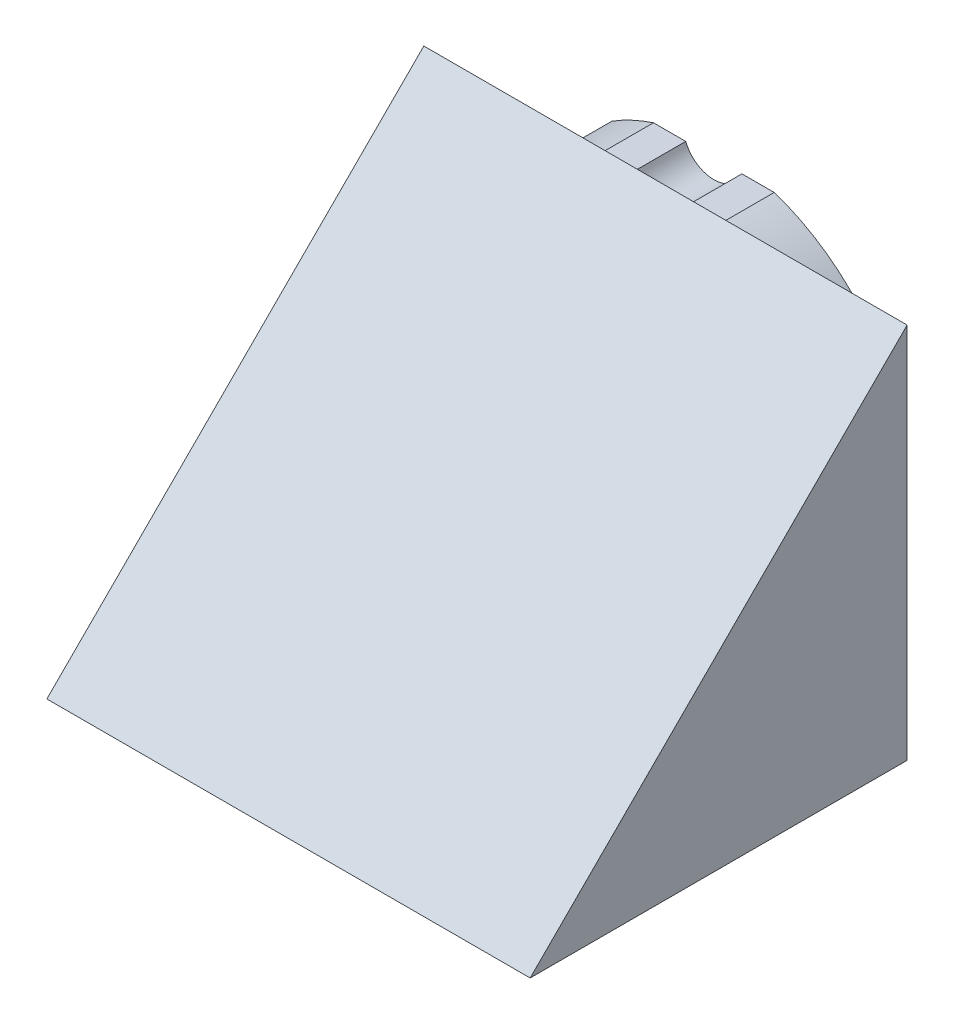
ISO-10303-21;
HEADER;
FILE_DESCRIPTION(('STEP AP214'),'2;1');
FILE_NAME('part.step','',(''),(''),'','','');
FILE_SCHEMA(('AUTOMOTIVE_DESIGN { 1 0 10303 214 1 1 1 1 }'));
ENDSEC;
DATA;
#1=APPLICATION_CONTEXT('core data for automotive mechanical design processes');
#2=APPLICATION_PROTOCOL_DEFINITION('international standard','automotive_design',2000,#1);
#3=PRODUCT_CONTEXT('',#1,'mechanical');
#4=PRODUCT('Part','Part','',(#3));
#5=PRODUCT_RELATED_PRODUCT_CATEGORY('part','',(#4));
#6=PRODUCT_DEFINITION_FORMATION('','',#4);
#7=PRODUCT_DEFINITION_CONTEXT('part definition',#1,'design');
#8=PRODUCT_DEFINITION('design','',#6,#7);
#9=PRODUCT_DEFINITION_SHAPE('','',#8);
#10=(LENGTH_UNIT() NAMED_UNIT(*) SI_UNIT(.MILLI.,.METRE.));
#11=(NAMED_UNIT(*) PLANE_ANGLE_UNIT() SI_UNIT($,.RADIAN.));
#12=(NAMED_UNIT(*) SI_UNIT($,.STERADIAN.) SOLID_ANGLE_UNIT());
#13=UNCERTAINTY_MEASURE_WITH_UNIT(LENGTH_MEASURE(1.E-05),#10,'distance_accuracy_value','');
#14=(GEOMETRIC_REPRESENTATION_CONTEXT(3) GLOBAL_UNCERTAINTY_ASSIGNED_CONTEXT((#13)) GLOBAL_UNIT_ASSIGNED_CONTEXT((#10,
#11,#12)) REPRESENTATION_CONTEXT('',''));
#15=CARTESIAN_POINT('',(0.,0.,0.));
#16=DIRECTION('',(0.,0.,1.));
#17=DIRECTION('',(1.,0.,0.));
#18=AXIS2_PLACEMENT_3D('',#15,#16,#17);
#19=CARTESIAN_POINT('',(-1.11022302462516E-13,40.3000000000001,9.99999999999989));
#20=DIRECTION('',(0.,0.,-1.));
#21=DIRECTION('',(-1.,0.,0.));
#22=AXIS2_PLACEMENT_3D('',#19,#20,#21);
#23=CYLINDRICAL_SURFACE('',#22,6.25);
#24=CARTESIAN_POINT('',(-1.11022302462516E-13,40.3000000000001,-1.11022302462516E-13));
#25=DIRECTION('',(0.,0.,1.));
#26=DIRECTION('',(0.999999999999998,0.,0.));
#27=AXIS2_PLACEMENT_3D('',#24,#25,#26);
#28=CIRCLE('',#27,6.25);
#29=CARTESIAN_POINT('',(5.81141115778711,37.9999999227946,-1.11022302462516E-13));
#30=VERTEX_POINT('',#29);
#31=CARTESIAN_POINT('',(-5.81141115778742,37.9999999227946,-1.66533453693773E-13));
#32=VERTEX_POINT('',#31);
#33=EDGE_CURVE('E216',#30,#32,#28,.F.);
#34=ORIENTED_EDGE('',*,*,#33,.T.);
#35=DIRECTION('',(0.,0.,-1.));
#36=VECTOR('',#35,1.);
#37=CARTESIAN_POINT('',(-5.81141115778742,37.9999999227946,9.99999999999983));
#38=LINE('',#37,#36);
#39=CARTESIAN_POINT('',(-5.81141115778742,37.9999999227946,9.99999999999983));
#40=VERTEX_POINT('',#39);
#41=EDGE_CURVE('E11',#40,#32,#38,.T.);
#42=ORIENTED_EDGE('',*,*,#41,.F.);
#43=CARTESIAN_POINT('',(-1.11022302462516E-13,40.3000000000001,9.99999999999989));
#44=DIRECTION('',(0.,0.,1.));
#45=DIRECTION('',(0.999999999999998,0.,0.));
#46=AXIS2_PLACEMENT_3D('',#43,#44,#45);
#47=CIRCLE('',#46,6.25);
#48=CARTESIAN_POINT('',(5.81141115778711,37.9999999227946,9.99999999999989));
#49=VERTEX_POINT('',#48);
#50=EDGE_CURVE('E368',#49,#40,#47,.F.);
#51=ORIENTED_EDGE('',*,*,#50,.F.);
#52=DIRECTION('',(0.,0.,-1.));
#53=VECTOR('',#52,1.);
#54=CARTESIAN_POINT('',(5.81141115778711,37.9999999227946,9.99999999999989));
#55=LINE('',#54,#53);
#56=EDGE_CURVE('E57',#49,#30,#55,.T.);
#57=ORIENTED_EDGE('',*,*,#56,.T.);
#58=EDGE_LOOP('',(#34,#42,#51,#57));
#59=FACE_BOUND('',#58,.T.);
#60=ADVANCED_FACE('F33',(#59),#23,.F.);
#61=CARTESIAN_POINT('',(-1.66533453693773E-13,38.0000000000001,9.99999999999972));
#62=DIRECTION('',(0.,-1.,0.));
#63=DIRECTION('',(1.,0.,0.));
#64=AXIS2_PLACEMENT_3D('',#61,#62,#63);
#65=PLANE('',#64);
#66=DIRECTION('',(-0.999999999999998,0.,0.));
#67=VECTOR('',#66,1.);
#68=CARTESIAN_POINT('',(-1.66533453693773E-13,38.0000000000001,-2.77555756156289E-13));
#69=LINE('',#68,#67);
#70=CARTESIAN_POINT('',(-12.4899964724862,37.9999998436485,-1.11022302462516E-13));
#71=VERTEX_POINT('',#70);
#72=EDGE_CURVE('E219',#32,#71,#69,.T.);
#73=ORIENTED_EDGE('',*,*,#72,.T.);
#74=DIRECTION('',(0.,0.,-1.));
#75=VECTOR('',#74,1.);
#76=CARTESIAN_POINT('',(-12.4899964724862,37.9999998436485,9.99999999999989));
#77=LINE('',#76,#75);
#78=CARTESIAN_POINT('',(-12.4899964724862,37.9999998436485,9.99999999999989));
#79=VERTEX_POINT('',#78);
#80=EDGE_CURVE('E41',#79,#71,#77,.T.);
#81=ORIENTED_EDGE('',*,*,#80,.F.);
#82=DIRECTION('',(-0.999999999999998,0.,0.));
#83=VECTOR('',#82,1.);
#84=CARTESIAN_POINT('',(-1.66533453693773E-13,38.0000000000001,9.99999999999972));
#85=LINE('',#84,#83);
#86=EDGE_CURVE('E126',#40,#79,#85,.T.);
#87=ORIENTED_EDGE('',*,*,#86,.F.);
#88=ORIENTED_EDGE('',*,*,#41,.T.);
#89=EDGE_LOOP('',(#73,#81,#87,#88));
#90=FACE_BOUND('',#89,.T.);
#91=ADVANCED_FACE('F433',(#90),#65,.F.);
#92=CARTESIAN_POINT('',(-1.11022302462516E-13,0.,9.99999999999972));
#93=DIRECTION('',(0.,0.,-1.));
#94=DIRECTION('',(-1.,0.,0.));
#95=AXIS2_PLACEMENT_3D('',#92,#93,#94);
#96=CYLINDRICAL_SURFACE('',#95,40.);
#97=CARTESIAN_POINT('',(-1.11022302462516E-13,0.,-2.77555756156289E-13));
#98=DIRECTION('',(0.,0.,1.));
#99=DIRECTION('',(0.999999999999998,0.,0.));
#100=AXIS2_PLACEMENT_3D('',#97,#98,#99);
#101=CIRCLE('',#100,40.);
#102=CARTESIAN_POINT('',(-21.0896489382124,33.9886261514491,-1.11022302462516E-13));
#103=VERTEX_POINT('',#102);
#104=EDGE_CURVE('E221',#71,#103,#101,.T.);
#105=ORIENTED_EDGE('',*,*,#104,.T.);
#106=DIRECTION('',(0.,0.,-1.));
#107=VECTOR('',#106,1.);
#108=CARTESIAN_POINT('',(-21.0896489382124,33.9886261514491,9.99999999999989));
#109=LINE('',#108,#107);
#110=CARTESIAN_POINT('',(-21.0896489382124,33.9886261514491,9.99999999999989));
#111=VERTEX_POINT('',#110);
#112=EDGE_CURVE('E287',#111,#103,#109,.T.);
#113=ORIENTED_EDGE('',*,*,#112,.F.);
#114=CARTESIAN_POINT('',(-1.11022302462516E-13,0.,9.99999999999972));
#115=DIRECTION('',(0.,0.,1.));
#116=DIRECTION('',(0.999999999999998,0.,0.));
#117=AXIS2_PLACEMENT_3D('',#114,#115,#116);
#118=CIRCLE('',#117,40.);
#119=EDGE_CURVE('E295',#79,#111,#118,.T.);
#120=ORIENTED_EDGE('',*,*,#119,.F.);
#121=ORIENTED_EDGE('',*,*,#80,.T.);
#122=EDGE_LOOP('',(#105,#113,#120,#121));
#123=FACE_BOUND('',#122,.T.);
#124=ADVANCED_FACE('F293',(#123),#96,.T.);
#125=CARTESIAN_POINT('',(3.88572980728433,3.14660195524888,9.99999999999983));
#126=DIRECTION('',(0.777145961456976,0.629320391049832,0.));
#127=DIRECTION('',(-0.629320391049832,0.777145961456976,0.));
#128=AXIS2_PLACEMENT_3D('',#125,#126,#127);
#129=PLANE('',#128);
#130=DIRECTION('',(0.629320391049832,-0.777145961456976,0.));
#131=VECTOR('',#130,1.);
#132=CARTESIAN_POINT('',(3.88572980728433,3.14660195524888,-1.66533453693773E-13));
#133=LINE('',#132,#131);
#134=CARTESIAN_POINT('',(-17.322367367557,29.33642085198,-1.11022302462516E-13));
#135=VERTEX_POINT('',#134);
#136=EDGE_CURVE('E223',#103,#135,#133,.T.);
#137=ORIENTED_EDGE('',*,*,#136,.T.);
#138=DIRECTION('',(0.,0.,-1.));
#139=VECTOR('',#138,1.);
#140=CARTESIAN_POINT('',(-17.322367367557,29.33642085198,9.99999999999989));
#141=LINE('',#140,#139);
#142=CARTESIAN_POINT('',(-17.322367367557,29.33642085198,9.99999999999989));
#143=VERTEX_POINT('',#142);
#144=EDGE_CURVE('E284',#143,#135,#141,.T.);
#145=ORIENTED_EDGE('',*,*,#144,.F.);
#146=DIRECTION('',(0.629320391049832,-0.777145961456976,0.));
#147=VECTOR('',#146,1.);
#148=CARTESIAN_POINT('',(3.88572980728433,3.14660195524888,9.99999999999983));
#149=LINE('',#148,#147);
#150=EDGE_CURVE('E316',#111,#143,#149,.T.);
#151=ORIENTED_EDGE('',*,*,#150,.F.);
#152=ORIENTED_EDGE('',*,*,#112,.T.);
#153=EDGE_LOOP('',(#137,#145,#151,#152));
#154=FACE_BOUND('',#153,.T.);
#155=ADVANCED_FACE('F304',(#154),#129,.F.);
#156=CARTESIAN_POINT('',(-19.032088486301,27.9519159960392,9.99999999999983));
#157=DIRECTION('',(0.,0.,-1.));
#158=DIRECTION('',(-1.,0.,0.));
#159=AXIS2_PLACEMENT_3D('',#156,#157,#158);
#160=CYLINDRICAL_SURFACE('',#159,2.20000000000058);
#161=CARTESIAN_POINT('',(-19.032088486301,27.9519159960392,-1.66533453693773E-13));
#162=DIRECTION('',(0.,0.,1.));
#163=DIRECTION('',(0.999999999999998,0.,0.));
#164=AXIS2_PLACEMENT_3D('',#161,#162,#163);
#165=CIRCLE('',#164,2.20000000000058);
#166=CARTESIAN_POINT('',(-17.6475836259901,26.2421948808341,0.));
#167=VERTEX_POINT('',#166);
#168=EDGE_CURVE('E225',#135,#167,#165,.F.);
#169=ORIENTED_EDGE('',*,*,#168,.T.);
#170=DIRECTION('',(0.,0.,-1.));
#171=VECTOR('',#170,1.);
#172=CARTESIAN_POINT('',(-17.6475836259901,26.2421948808341,10.));
#173=LINE('',#172,#171);
#174=CARTESIAN_POINT('',(-17.6475836259901,26.2421948808341,10.));
#175=VERTEX_POINT('',#174);
#176=EDGE_CURVE('E281',#175,#167,#173,.T.);
#177=ORIENTED_EDGE('',*,*,#176,.F.);
#178=CARTESIAN_POINT('',(-19.032088486301,27.9519159960392,9.99999999999983));
#179=DIRECTION('',(0.,0.,1.));
#180=DIRECTION('',(0.999999999999998,0.,0.));
#181=AXIS2_PLACEMENT_3D('',#178,#179,#180);
#182=CIRCLE('',#181,2.20000000000058);
#183=EDGE_CURVE('E310',#143,#175,#182,.F.);
#184=ORIENTED_EDGE('',*,*,#183,.F.);
#185=ORIENTED_EDGE('',*,*,#144,.T.);
#186=EDGE_LOOP('',(#169,#177,#184,#185));
#187=FACE_BOUND('',#186,.T.);
#188=ADVANCED_FACE('F308',(#187),#160,.F.);
#189=CARTESIAN_POINT('',(-19.8235923180695,24.4800977858946,9.99999999999989));
#190=DIRECTION('',(0.629320391049831,-0.777145961456976,0.));
#191=DIRECTION('',(0.777145961456976,0.629320391049831,0.));
#192=AXIS2_PLACEMENT_3D('',#189,#190,#191);
#193=PLANE('',#192);
#194=DIRECTION('',(-0.777145961456976,-0.629320391049831,0.));
#195=VECTOR('',#194,1.);
#196=CARTESIAN_POINT('',(-19.8235923180695,24.4800977858946,-1.11022302462516E-13));
#197=LINE('',#196,#195);
#198=CARTESIAN_POINT('',(-21.9996010145181,22.718000687417,0.));
#199=VERTEX_POINT('',#198);
#200=EDGE_CURVE('E227',#167,#199,#197,.T.);
#201=ORIENTED_EDGE('',*,*,#200,.T.);
#202=DIRECTION('',(0.,0.,-1.));
#203=VECTOR('',#202,1.);
#204=CARTESIAN_POINT('',(-21.9996010145181,22.718000687417,10.));
#205=LINE('',#204,#203);
#206=CARTESIAN_POINT('',(-21.9996010145181,22.718000687417,10.));
#207=VERTEX_POINT('',#206);
#208=EDGE_CURVE('E278',#207,#199,#205,.T.);
#209=ORIENTED_EDGE('',*,*,#208,.F.);
#210=DIRECTION('',(-0.777145961456976,-0.629320391049831,0.));
#211=VECTOR('',#210,1.);
#212=CARTESIAN_POINT('',(-19.8235923180695,24.4800977858946,9.99999999999989));
#213=LINE('',#212,#211);
#214=EDGE_CURVE('E315',#175,#207,#213,.T.);
#215=ORIENTED_EDGE('',*,*,#214,.F.);
#216=ORIENTED_EDGE('',*,*,#176,.T.);
#217=EDGE_LOOP('',(#201,#209,#215,#216));
#218=FACE_BOUND('',#217,.T.);
#219=ADVANCED_FACE('F506',(#218),#193,.F.);
#220=CARTESIAN_POINT('',(-23.3841058704586,24.4277218061594,10.));
#221=DIRECTION('',(0.,0.,-1.));
#222=DIRECTION('',(-1.,0.,0.));
#223=AXIS2_PLACEMENT_3D('',#220,#221,#222);
#224=CYLINDRICAL_SURFACE('',#223,2.19999999999924);
#225=CARTESIAN_POINT('',(-23.3841058704586,24.4277218061594,0.));
#226=DIRECTION('',(0.,0.,1.));
#227=DIRECTION('',(0.999999999999998,0.,0.));
#228=AXIS2_PLACEMENT_3D('',#225,#226,#227);
#229=CIRCLE('',#228,2.19999999999924);
#230=CARTESIAN_POINT('',(-25.0938269856641,23.043216945851,-1.66533453693773E-13));
#231=VERTEX_POINT('',#230);
#232=EDGE_CURVE('E229',#199,#231,#229,.F.);
#233=ORIENTED_EDGE('',*,*,#232,.T.);
#234=DIRECTION('',(0.,0.,-1.));
#235=VECTOR('',#234,1.);
#236=CARTESIAN_POINT('',(-25.0938269856641,23.043216945851,9.99999999999983));
#237=LINE('',#236,#235);
#238=CARTESIAN_POINT('',(-25.0938269856641,23.043216945851,9.99999999999983));
#239=VERTEX_POINT('',#238);
#240=EDGE_CURVE('E275',#239,#231,#237,.T.);
#241=ORIENTED_EDGE('',*,*,#240,.F.);
#242=CARTESIAN_POINT('',(-23.3841058704586,24.4277218061594,10.));
#243=DIRECTION('',(0.,0.,1.));
#244=DIRECTION('',(0.999999999999998,0.,0.));
#245=AXIS2_PLACEMENT_3D('',#242,#243,#244);
#246=CIRCLE('',#245,2.19999999999924);
#247=EDGE_CURVE('E324',#207,#239,#246,.F.);
#248=ORIENTED_EDGE('',*,*,#247,.F.);
#249=ORIENTED_EDGE('',*,*,#208,.T.);
#250=EDGE_LOOP('',(#233,#241,#248,#249));
#251=FACE_BOUND('',#250,.T.);
#252=ADVANCED_FACE('F502',(#251),#224,.F.);
#253=CARTESIAN_POINT('',(-3.88572980728483,-3.14660195524891,9.99999999999972));
#254=DIRECTION('',(-0.777145961456975,-0.629320391049833,0.));
#255=DIRECTION('',(0.629320391049833,-0.777145961456975,0.));
#256=AXIS2_PLACEMENT_3D('',#253,#254,#255);
#257=PLANE('',#256);
#258=DIRECTION('',(-0.629320391049833,0.777145961456974,0.));
#259=VECTOR('',#258,1.);
#260=CARTESIAN_POINT('',(-3.88572980728483,-3.14660195524891,-2.77555756156289E-13));
#261=LINE('',#260,#259);
#262=CARTESIAN_POINT('',(-28.8611088859962,27.6954218937117,0.));
#263=VERTEX_POINT('',#262);
#264=EDGE_CURVE('E231',#231,#263,#261,.T.);
#265=ORIENTED_EDGE('',*,*,#264,.T.);
#266=DIRECTION('',(0.,0.,-1.));
#267=VECTOR('',#266,1.);
#268=CARTESIAN_POINT('',(-28.8611088859962,27.6954218937117,10.));
#269=LINE('',#268,#267);
#270=CARTESIAN_POINT('',(-28.8611088859962,27.6954218937117,10.));
#271=VERTEX_POINT('',#270);
#272=EDGE_CURVE('E272',#271,#263,#269,.T.);
#273=ORIENTED_EDGE('',*,*,#272,.F.);
#274=DIRECTION('',(-0.629320391049833,0.777145961456974,0.));
#275=VECTOR('',#274,1.);
#276=CARTESIAN_POINT('',(-3.88572980728483,-3.14660195524891,9.99999999999972));
#277=LINE('',#276,#275);
#278=EDGE_CURVE('E327',#239,#271,#277,.T.);
#279=ORIENTED_EDGE('',*,*,#278,.F.);
#280=ORIENTED_EDGE('',*,*,#240,.T.);
#281=EDGE_LOOP('',(#265,#273,#279,#280));
#282=FACE_BOUND('',#281,.T.);
#283=ADVANCED_FACE('F498',(#282),#257,.F.);
#284=CARTESIAN_POINT('',(-1.11022302462516E-13,0.,9.99999999999972));
#285=DIRECTION('',(0.,0.,-1.));
#286=DIRECTION('',(-1.,0.,0.));
#287=AXIS2_PLACEMENT_3D('',#284,#285,#286);
#288=CYLINDRICAL_SURFACE('',#287,40.);
#289=CARTESIAN_POINT('',(-1.11022302462516E-13,0.,-2.77555756156289E-13));
#290=DIRECTION('',(0.,0.,1.));
#291=DIRECTION('',(0.999999999999998,0.,0.));
#292=AXIS2_PLACEMENT_3D('',#289,#290,#291);
#293=CIRCLE('',#292,40.);
#294=CARTESIAN_POINT('',(-39.1539633422071,-8.18334617360796,0.));
#295=VERTEX_POINT('',#294);
#296=EDGE_CURVE('E233',#263,#295,#293,.T.);
#297=ORIENTED_EDGE('',*,*,#296,.T.);
#298=DIRECTION('',(0.,0.,-1.));
#299=VECTOR('',#298,1.);
#300=CARTESIAN_POINT('',(-39.1539633422071,-8.18334617360796,10.));
#301=LINE('',#300,#299);
#302=CARTESIAN_POINT('',(-39.1539633422071,-8.18334617360796,10.));
#303=VERTEX_POINT('',#302);
#304=EDGE_CURVE('E269',#303,#295,#301,.T.);
#305=ORIENTED_EDGE('',*,*,#304,.F.);
#306=CARTESIAN_POINT('',(-1.11022302462516E-13,0.,9.99999999999972));
#307=DIRECTION('',(0.,0.,1.));
#308=DIRECTION('',(0.999999999999998,0.,0.));
#309=AXIS2_PLACEMENT_3D('',#306,#307,#308);
#310=CIRCLE('',#309,40.);
#311=EDGE_CURVE('E330',#271,#303,#310,.T.);
#312=ORIENTED_EDGE('',*,*,#311,.F.);
#313=ORIENTED_EDGE('',*,*,#272,.T.);
#314=EDGE_LOOP('',(#297,#305,#312,#313));
#315=FACE_BOUND('',#314,.T.);
#316=ADVANCED_FACE('F494',(#315),#288,.T.);
#317=CARTESIAN_POINT('',(-32.9089653438086,-19.,10.));
#318=DIRECTION('',(0.866025403784438,0.5,0.));
#319=DIRECTION('',(-0.5,0.866025403784439,0.));
#320=AXIS2_PLACEMENT_3D('',#317,#318,#319);
#321=PLANE('',#320);
#322=DIRECTION('',(0.5,-0.866025403784439,0.));
#323=VECTOR('',#322,1.);
#324=CARTESIAN_POINT('',(-32.9089653438086,-19.,0.));
#325=LINE('',#324,#323);
#326=CARTESIAN_POINT('',(-35.8146061712768,-13.9672825107836,0.));
#327=VERTEX_POINT('',#326);
#328=EDGE_CURVE('E235',#295,#327,#325,.T.);
#329=ORIENTED_EDGE('',*,*,#328,.T.);
#330=DIRECTION('',(0.,0.,-1.));
#331=VECTOR('',#330,1.);
#332=CARTESIAN_POINT('',(-35.8146061712768,-13.9672825107836,10.));
#333=LINE('',#332,#331);
#334=CARTESIAN_POINT('',(-35.8146061712768,-13.9672825107836,10.));
#335=VERTEX_POINT('',#334);
#336=EDGE_CURVE('E266',#335,#327,#333,.T.);
#337=ORIENTED_EDGE('',*,*,#336,.F.);
#338=DIRECTION('',(0.5,-0.866025403784439,0.));
#339=VECTOR('',#338,1.);
#340=CARTESIAN_POINT('',(-32.9089653438086,-19.,10.));
#341=LINE('',#340,#339);
#342=EDGE_CURVE('E333',#303,#335,#341,.T.);
#343=ORIENTED_EDGE('',*,*,#342,.F.);
#344=ORIENTED_EDGE('',*,*,#304,.T.);
#345=EDGE_LOOP('',(#329,#337,#343,#344));
#346=FACE_BOUND('',#345,.T.);
#347=ADVANCED_FACE('F490',(#346),#321,.F.);
#348=CARTESIAN_POINT('',(-34.9000000000001,-20.15,9.99999999999989));
#349=DIRECTION('',(0.,0.,-1.));
#350=DIRECTION('',(-1.,0.,0.));
#351=AXIS2_PLACEMENT_3D('',#348,#349,#350);
#352=CYLINDRICAL_SURFACE('',#351,6.25);
#353=CARTESIAN_POINT('',(-34.9000000000001,-20.15,-1.11022302462516E-13));
#354=DIRECTION('',(0.,0.,1.));
#355=DIRECTION('',(0.999999999999998,0.,0.));
#356=AXIS2_PLACEMENT_3D('',#353,#354,#355);
#357=CIRCLE('',#356,6.25);
#358=CARTESIAN_POINT('',(-30.0029126580125,-24.0334309012708,0.));
#359=VERTEX_POINT('',#358);
#360=EDGE_CURVE('E237',#327,#359,#357,.F.);
#361=ORIENTED_EDGE('',*,*,#360,.T.);
#362=DIRECTION('',(0.,0.,-1.));
#363=VECTOR('',#362,1.);
#364=CARTESIAN_POINT('',(-30.0029126580125,-24.0334309012708,10.));
#365=LINE('',#364,#363);
#366=CARTESIAN_POINT('',(-30.0029126580125,-24.0334309012708,10.));
#367=VERTEX_POINT('',#366);
#368=EDGE_CURVE('E263',#367,#359,#365,.T.);
#369=ORIENTED_EDGE('',*,*,#368,.F.);
#370=CARTESIAN_POINT('',(-34.9000000000001,-20.15,9.99999999999989));
#371=DIRECTION('',(0.,0.,1.));
#372=DIRECTION('',(0.999999999999998,0.,0.));
#373=AXIS2_PLACEMENT_3D('',#370,#371,#372);
#374=CIRCLE('',#373,6.25);
#375=EDGE_CURVE('E336',#335,#367,#374,.F.);
#376=ORIENTED_EDGE('',*,*,#375,.F.);
#377=ORIENTED_EDGE('',*,*,#336,.T.);
#378=EDGE_LOOP('',(#361,#369,#376,#377));
#379=FACE_BOUND('',#378,.T.);
#380=ADVANCED_FACE('F486',(#379),#352,.F.);
#381=CARTESIAN_POINT('',(-32.9089653438086,-19.,10.));
#382=DIRECTION('',(0.866025403784438,0.5,0.));
#383=DIRECTION('',(-0.5,0.866025403784439,0.));
#384=AXIS2_PLACEMENT_3D('',#381,#382,#383);
#385=PLANE('',#384);
#386=DIRECTION('',(0.5,-0.866025403784439,0.));
#387=VECTOR('',#386,1.);
#388=CARTESIAN_POINT('',(-32.9089653438086,-19.,0.));
#389=LINE('',#388,#387);
#390=CARTESIAN_POINT('',(-26.663967245574,-29.816653915672,0.));
#391=VERTEX_POINT('',#390);
#392=EDGE_CURVE('E239',#359,#391,#389,.T.);
#393=ORIENTED_EDGE('',*,*,#392,.T.);
#394=DIRECTION('',(0.,0.,-1.));
#395=VECTOR('',#394,1.);
#396=CARTESIAN_POINT('',(-26.663967245574,-29.816653915672,10.));
#397=LINE('',#396,#395);
#398=CARTESIAN_POINT('',(-26.663967245574,-29.816653915672,10.));
#399=VERTEX_POINT('',#398);
#400=EDGE_CURVE('E260',#399,#391,#397,.T.);
#401=ORIENTED_EDGE('',*,*,#400,.F.);
#402=DIRECTION('',(0.5,-0.866025403784439,0.));
#403=VECTOR('',#402,1.);
#404=CARTESIAN_POINT('',(-32.9089653438086,-19.,10.));
#405=LINE('',#404,#403);
#406=EDGE_CURVE('E339',#367,#399,#405,.T.);
#407=ORIENTED_EDGE('',*,*,#406,.F.);
#408=ORIENTED_EDGE('',*,*,#368,.T.);
#409=EDGE_LOOP('',(#393,#401,#407,#408));
#410=FACE_BOUND('',#409,.T.);
#411=ADVANCED_FACE('F483',(#410),#385,.F.);
#412=CARTESIAN_POINT('',(-1.11022302462516E-13,0.,9.99999999999972));
#413=DIRECTION('',(0.,0.,-1.));
#414=DIRECTION('',(-1.,0.,0.));
#415=AXIS2_PLACEMENT_3D('',#412,#413,#414);
#416=CYLINDRICAL_SURFACE('',#415,40.);
#417=CARTESIAN_POINT('',(-1.11022302462516E-13,0.,-2.77555756156289E-13));
#418=DIRECTION('',(0.,0.,1.));
#419=DIRECTION('',(0.999999999999998,0.,0.));
#420=AXIS2_PLACEMENT_3D('',#417,#418,#419);
#421=CIRCLE('',#420,40.);
#422=CARTESIAN_POINT('',(26.66396734541,-29.816653826392,0.));
#423=VERTEX_POINT('',#422);
#424=EDGE_CURVE('E241',#391,#423,#421,.T.);
#425=ORIENTED_EDGE('',*,*,#424,.T.);
#426=DIRECTION('',(0.,0.,-1.));
#427=VECTOR('',#426,1.);
#428=CARTESIAN_POINT('',(26.66396734541,-29.816653826392,10.));
#429=LINE('',#428,#427);
#430=CARTESIAN_POINT('',(26.66396734541,-29.816653826392,10.));
#431=VERTEX_POINT('',#430);
#432=EDGE_CURVE('E257',#431,#423,#429,.T.);
#433=ORIENTED_EDGE('',*,*,#432,.F.);
#434=CARTESIAN_POINT('',(-1.11022302462516E-13,0.,9.99999999999972));
#435=DIRECTION('',(0.,0.,1.));
#436=DIRECTION('',(0.999999999999998,0.,0.));
#437=AXIS2_PLACEMENT_3D('',#434,#435,#436);
#438=CIRCLE('',#437,40.);
#439=CARTESIAN_POINT('',(-1.11022302462516E-13,-40.0000000000002,9.99999999999972));
#440=VERTEX_POINT('',#439);
#441=EDGE_CURVE('E48',#440,#431,#438,.T.);
#442=ORIENTED_EDGE('',*,*,#441,.F.);
#443=EDGE_CURVE('E198',#399,#440,#438,.T.);
#444=ORIENTED_EDGE('',*,*,#443,.F.);
#445=ORIENTED_EDGE('',*,*,#400,.T.);
#446=EDGE_LOOP('',(#425,#433,#442,#444,#445));
#447=FACE_BOUND('',#446,.T.);
#448=ADVANCED_FACE('F479',(#447),#416,.T.);
#449=CARTESIAN_POINT('',(32.9089653438083,-18.9999999999999,9.99999999999989));
#450=DIRECTION('',(-0.866025403784438,0.5,0.));
#451=DIRECTION('',(-0.5,-0.866025403784439,0.));
#452=AXIS2_PLACEMENT_3D('',#449,#450,#451);
#453=PLANE('',#452);
#454=DIRECTION('',(0.5,0.866025403784439,0.));
#455=VECTOR('',#454,1.);
#456=CARTESIAN_POINT('',(32.9089653438083,-18.9999999999999,-1.11022302462516E-13));
#457=LINE('',#456,#455);
#458=CARTESIAN_POINT('',(30.0029126952653,-24.0334309482476,-2.77555756156289E-13));
#459=VERTEX_POINT('',#458);
#460=EDGE_CURVE('E243',#423,#459,#457,.T.);
#461=ORIENTED_EDGE('',*,*,#460,.T.);
#462=DIRECTION('',(0.,0.,-1.));
#463=VECTOR('',#462,1.);
#464=CARTESIAN_POINT('',(30.0029126952653,-24.0334309482476,9.99999999999972));
#465=LINE('',#464,#463);
#466=CARTESIAN_POINT('',(30.0029126952653,-24.0334309482476,9.99999999999972));
#467=VERTEX_POINT('',#466);
#468=EDGE_CURVE('E181',#467,#459,#465,.T.);
#469=ORIENTED_EDGE('',*,*,#468,.F.);
#470=DIRECTION('',(0.5,0.866025403784439,0.));
#471=VECTOR('',#470,1.);
#472=CARTESIAN_POINT('',(32.9089653438083,-18.9999999999999,9.99999999999989));
#473=LINE('',#472,#471);
#474=EDGE_CURVE('E196',#431,#467,#473,.T.);
#475=ORIENTED_EDGE('',*,*,#474,.F.);
#476=ORIENTED_EDGE('',*,*,#432,.T.);
#477=EDGE_LOOP('',(#461,#469,#475,#476));
#478=FACE_BOUND('',#477,.T.);
#479=ADVANCED_FACE('F476',(#478),#453,.F.);
#480=CARTESIAN_POINT('',(34.8999999999997,-20.1499999999999,9.99999999999972));
#481=DIRECTION('',(0.,0.,-1.));
#482=DIRECTION('',(-1.,0.,0.));
#483=AXIS2_PLACEMENT_3D('',#480,#481,#482);
#484=CYLINDRICAL_SURFACE('',#483,6.25);
#485=CARTESIAN_POINT('',(34.8999999999997,-20.1499999999999,-2.77555756156289E-13));
#486=DIRECTION('',(0.,0.,1.));
#487=DIRECTION('',(0.999999999999998,0.,0.));
#488=AXIS2_PLACEMENT_3D('',#485,#486,#487);
#489=CIRCLE('',#488,6.25);
#490=CARTESIAN_POINT('',(35.8146061433479,-13.9672825066521,-2.22044604925031E-13));
#491=VERTEX_POINT('',#490);
#492=EDGE_CURVE('E178',#459,#491,#489,.F.);
#493=ORIENTED_EDGE('',*,*,#492,.T.);
#494=DIRECTION('',(0.,0.,-1.));
#495=VECTOR('',#494,1.);
#496=CARTESIAN_POINT('',(35.8146061433479,-13.9672825066521,9.99999999999978));
#497=LINE('',#496,#495);
#498=CARTESIAN_POINT('',(35.8146061433479,-13.9672825066521,9.99999999999978));
#499=VERTEX_POINT('',#498);
#500=EDGE_CURVE('E170',#499,#491,#497,.T.);
#501=ORIENTED_EDGE('',*,*,#500,.F.);
#502=CARTESIAN_POINT('',(34.8999999999997,-20.1499999999999,9.99999999999972));
#503=DIRECTION('',(0.,0.,1.));
#504=DIRECTION('',(0.999999999999998,0.,0.));
#505=AXIS2_PLACEMENT_3D('',#502,#503,#504);
#506=CIRCLE('',#505,6.25);
#507=EDGE_CURVE('E175',#467,#499,#506,.F.);
#508=ORIENTED_EDGE('',*,*,#507,.F.);
#509=ORIENTED_EDGE('',*,*,#468,.T.);
#510=EDGE_LOOP('',(#493,#501,#508,#509));
#511=FACE_BOUND('',#510,.T.);
#512=ADVANCED_FACE('F172',(#511),#484,.F.);
#513=CARTESIAN_POINT('',(32.9089653438083,-18.9999999999999,9.99999999999989));
#514=DIRECTION('',(-0.866025403784438,0.5,0.));
#515=DIRECTION('',(-0.5,-0.866025403784439,0.));
#516=AXIS2_PLACEMENT_3D('',#513,#514,#515);
#517=PLANE('',#516);
#518=DIRECTION('',(0.5,0.866025403784439,0.));
#519=VECTOR('',#518,1.);
#520=CARTESIAN_POINT('',(32.9089653438083,-18.9999999999999,-1.11022302462516E-13));
#521=LINE('',#520,#519);
#522=CARTESIAN_POINT('',(39.1539632209339,-8.183346753849,-2.22044604925031E-13));
#523=VERTEX_POINT('',#522);
#524=EDGE_CURVE('E246',#491,#523,#521,.T.);
#525=ORIENTED_EDGE('',*,*,#524,.T.);
#526=DIRECTION('',(0.,0.,-1.));
#527=VECTOR('',#526,1.);
#528=CARTESIAN_POINT('',(39.1539632209339,-8.183346753849,9.99999999999978));
#529=LINE('',#528,#527);
#530=CARTESIAN_POINT('',(39.1539632209339,-8.183346753849,9.99999999999978));
#531=VERTEX_POINT('',#530);
#532=EDGE_CURVE('E182',#531,#523,#529,.T.);
#533=ORIENTED_EDGE('',*,*,#532,.F.);
#534=DIRECTION('',(0.5,0.866025403784439,0.));
#535=VECTOR('',#534,1.);
#536=CARTESIAN_POINT('',(32.9089653438083,-18.9999999999999,9.99999999999989));
#537=LINE('',#536,#535);
#538=EDGE_CURVE('E185',#499,#531,#537,.T.);
#539=ORIENTED_EDGE('',*,*,#538,.F.);
#540=ORIENTED_EDGE('',*,*,#500,.T.);
#541=EDGE_LOOP('',(#525,#533,#539,#540));
#542=FACE_BOUND('',#541,.T.);
#543=ADVANCED_FACE('F186',(#542),#517,.F.);
#544=CARTESIAN_POINT('',(-1.11022302462516E-13,0.,9.99999999999972));
#545=DIRECTION('',(0.,0.,-1.));
#546=DIRECTION('',(-1.,0.,0.));
#547=AXIS2_PLACEMENT_3D('',#544,#545,#546);
#548=CYLINDRICAL_SURFACE('',#547,40.);
#549=CARTESIAN_POINT('',(-1.11022302462516E-13,0.,-2.77555756156289E-13));
#550=DIRECTION('',(0.,0.,1.));
#551=DIRECTION('',(0.999999999999998,0.,0.));
#552=AXIS2_PLACEMENT_3D('',#549,#550,#551);
#553=CIRCLE('',#552,40.);
#554=CARTESIAN_POINT('',(12.4899959967968,38.0000000000001,-2.77555756156289E-13));
#555=VERTEX_POINT('',#554);
#556=EDGE_CURVE('E248',#523,#555,#553,.T.);
#557=ORIENTED_EDGE('',*,*,#556,.T.);
#558=DIRECTION('',(0.,0.,-1.));
#559=VECTOR('',#558,1.);
#560=CARTESIAN_POINT('',(12.4899959967968,38.0000000000001,9.99999999999972));
#561=LINE('',#560,#559);
#562=CARTESIAN_POINT('',(12.4899959967961,38.0000000000003,9.99999999999973));
#563=VERTEX_POINT('',#562);
#564=EDGE_CURVE('E253',#563,#555,#561,.T.);
#565=ORIENTED_EDGE('',*,*,#564,.F.);
#566=CARTESIAN_POINT('',(-1.11022302462516E-13,0.,9.99999999999972));
#567=DIRECTION('',(0.,0.,1.));
#568=DIRECTION('',(0.999999999999998,0.,0.));
#569=AXIS2_PLACEMENT_3D('',#566,#567,#568);
#570=CIRCLE('',#569,40.);
#571=EDGE_CURVE('E191',#531,#563,#570,.T.);
#572=ORIENTED_EDGE('',*,*,#571,.F.);
#573=ORIENTED_EDGE('',*,*,#532,.T.);
#574=EDGE_LOOP('',(#557,#565,#572,#573));
#575=FACE_BOUND('',#574,.T.);
#576=ADVANCED_FACE('F416',(#575),#548,.T.);
#577=CARTESIAN_POINT('',(-1.66533453693773E-13,-35.,9.99999999999989));
#578=DIRECTION('',(0.,0.,-1.));
#579=DIRECTION('',(-1.,0.,0.));
#580=AXIS2_PLACEMENT_3D('',#577,#578,#579);
#581=CYLINDRICAL_SURFACE('',#580,4.25);
#582=CARTESIAN_POINT('',(-1.66533453693773E-13,-35.,9.99999999999989));
#583=DIRECTION('',(0.,0.,1.));
#584=DIRECTION('',(0.999999999999998,0.,0.));
#585=AXIS2_PLACEMENT_3D('',#582,#583,#584);
#586=CIRCLE('',#585,4.25);
#587=CARTESIAN_POINT('',(4.24999999999983,-35.,9.99999999999989));
#588=VERTEX_POINT('',#587);
#589=EDGE_CURVE('E365',#588,#588,#586,.F.);
#590=ORIENTED_EDGE('',*,*,#589,.F.);
#591=EDGE_LOOP('',(#590));
#592=FACE_BOUND('',#591,.T.);
#593=CARTESIAN_POINT('',(-1.66533453693773E-13,-35.,-1.11022302462516E-13));
#594=DIRECTION('',(0.,0.,1.));
#595=DIRECTION('',(0.999999999999998,0.,0.));
#596=AXIS2_PLACEMENT_3D('',#593,#594,#595);
#597=CIRCLE('',#596,4.25);
#598=CARTESIAN_POINT('',(4.24999999999983,-35.,-1.12909681604378E-13));
#599=VERTEX_POINT('',#598);
#600=EDGE_CURVE('E213',#599,#599,#597,.F.);
#601=ORIENTED_EDGE('',*,*,#600,.T.);
#602=EDGE_LOOP('',(#601));
#603=FACE_BOUND('',#602,.T.);
#604=ADVANCED_FACE('F441',(#592,#603),#581,.F.);
#605=CARTESIAN_POINT('',(30.2999999999998,17.5000000000001,9.99999999999983));
#606=DIRECTION('',(0.,0.,-1.));
#607=DIRECTION('',(-1.,0.,0.));
#608=AXIS2_PLACEMENT_3D('',#605,#606,#607);
#609=CYLINDRICAL_SURFACE('',#608,4.25);
#610=CARTESIAN_POINT('',(30.2999999999998,17.5000000000001,9.99999999999983));
#611=DIRECTION('',(0.,0.,1.));
#612=DIRECTION('',(0.999999999999998,0.,0.));
#613=AXIS2_PLACEMENT_3D('',#610,#611,#612);
#614=CIRCLE('',#613,4.25);
#615=CARTESIAN_POINT('',(34.5499999999998,17.5000000000001,9.99999999999983));
#616=VERTEX_POINT('',#615);
#617=EDGE_CURVE('E362',#616,#616,#614,.F.);
#618=ORIENTED_EDGE('',*,*,#617,.F.);
#619=EDGE_LOOP('',(#618));
#620=FACE_BOUND('',#619,.T.);
#621=CARTESIAN_POINT('',(30.2999999999998,17.5000000000001,-1.66533453693773E-13));
#622=DIRECTION('',(0.,0.,1.));
#623=DIRECTION('',(0.999999999999998,0.,0.));
#624=AXIS2_PLACEMENT_3D('',#621,#622,#623);
#625=CIRCLE('',#624,4.25);
#626=CARTESIAN_POINT('',(34.5499999999998,17.5000000000001,-1.68420832835636E-13));
#627=VERTEX_POINT('',#626);
#628=EDGE_CURVE('E209',#627,#627,#625,.F.);
#629=ORIENTED_EDGE('',*,*,#628,.T.);
#630=EDGE_LOOP('',(#629));
#631=FACE_BOUND('',#630,.T.);
#632=ADVANCED_FACE('F443',(#620,#631),#609,.F.);
#633=CARTESIAN_POINT('',(-30.3000000000001,17.5000000000001,10.));
#634=DIRECTION('',(0.,0.,-1.));
#635=DIRECTION('',(-1.,0.,0.));
#636=AXIS2_PLACEMENT_3D('',#633,#634,#635);
#637=CYLINDRICAL_SURFACE('',#636,4.25);
#638=CARTESIAN_POINT('',(-30.3000000000001,17.5000000000001,10.));
#639=DIRECTION('',(0.,0.,1.));
#640=DIRECTION('',(0.999999999999998,0.,0.));
#641=AXIS2_PLACEMENT_3D('',#638,#639,#640);
#642=CIRCLE('',#641,4.25);
#643=CARTESIAN_POINT('',(-26.0500000000001,17.5000000000001,10.));
#644=VERTEX_POINT('',#643);
#645=EDGE_CURVE('E251',#644,#644,#642,.F.);
#646=ORIENTED_EDGE('',*,*,#645,.F.);
#647=EDGE_LOOP('',(#646));
#648=FACE_BOUND('',#647,.T.);
#649=CARTESIAN_POINT('',(-30.3000000000001,17.5000000000001,0.));
#650=DIRECTION('',(0.,0.,1.));
#651=DIRECTION('',(0.999999999999998,0.,0.));
#652=AXIS2_PLACEMENT_3D('',#649,#650,#651);
#653=CIRCLE('',#652,4.25);
#654=CARTESIAN_POINT('',(-26.0500000000001,17.5000000000001,0.));
#655=VERTEX_POINT('',#654);
#656=EDGE_CURVE('E206',#655,#655,#653,.F.);
#657=ORIENTED_EDGE('',*,*,#656,.T.);
#658=EDGE_LOOP('',(#657));
#659=FACE_BOUND('',#658,.T.);
#660=ADVANCED_FACE('F35',(#648,#659),#637,.F.);
#661=CARTESIAN_POINT('',(-1.66533453693773E-13,38.0000000000001,9.99999999999972));
#662=DIRECTION('',(0.,-1.,0.));
#663=DIRECTION('',(1.,0.,0.));
#664=AXIS2_PLACEMENT_3D('',#661,#662,#663);
#665=PLANE('',#664);
#666=DIRECTION('',(-0.999999999999998,0.,0.));
#667=VECTOR('',#666,1.);
#668=CARTESIAN_POINT('',(-1.66533453693773E-13,38.0000000000001,-2.77555756156289E-13));
#669=LINE('',#668,#667);
#670=EDGE_CURVE('E119',#555,#30,#669,.T.);
#671=ORIENTED_EDGE('',*,*,#670,.T.);
#672=ORIENTED_EDGE('',*,*,#56,.F.);
#673=DIRECTION('',(-0.999999999999998,0.,0.));
#674=VECTOR('',#673,1.);
#675=CARTESIAN_POINT('',(-1.66533453693773E-13,38.0000000000001,9.99999999999972));
#676=LINE('',#675,#674);
#677=EDGE_CURVE('E203',#563,#49,#676,.T.);
#678=ORIENTED_EDGE('',*,*,#677,.F.);
#679=ORIENTED_EDGE('',*,*,#564,.T.);
#680=EDGE_LOOP('',(#671,#672,#678,#679));
#681=FACE_BOUND('',#680,.T.);
#682=ADVANCED_FACE('F414',(#681),#665,.F.);
#683=CARTESIAN_POINT('',(0.,0.,0.));
#684=DIRECTION('',(0.,0.,1.00000000000006));
#685=DIRECTION('',(0.999999999999962,0.,0.));
#686=AXIS2_PLACEMENT_3D('',#683,#684,#685);
#687=PLANE('',#686);
#688=ORIENTED_EDGE('',*,*,#656,.F.);
#689=EDGE_LOOP('',(#688));
#690=FACE_BOUND('',#689,.T.);
#691=ORIENTED_EDGE('',*,*,#628,.F.);
#692=EDGE_LOOP('',(#691));
#693=FACE_BOUND('',#692,.T.);
#694=ORIENTED_EDGE('',*,*,#600,.F.);
#695=EDGE_LOOP('',(#694));
#696=FACE_BOUND('',#695,.T.);
#697=ORIENTED_EDGE('',*,*,#33,.F.);
#698=ORIENTED_EDGE('',*,*,#670,.F.);
#699=ORIENTED_EDGE('',*,*,#556,.F.);
#700=ORIENTED_EDGE('',*,*,#524,.F.);
#701=ORIENTED_EDGE('',*,*,#492,.F.);
#702=ORIENTED_EDGE('',*,*,#460,.F.);
#703=ORIENTED_EDGE('',*,*,#424,.F.);
#704=ORIENTED_EDGE('',*,*,#392,.F.);
#705=ORIENTED_EDGE('',*,*,#360,.F.);
#706=ORIENTED_EDGE('',*,*,#328,.F.);
#707=ORIENTED_EDGE('',*,*,#296,.F.);
#708=ORIENTED_EDGE('',*,*,#264,.F.);
#709=ORIENTED_EDGE('',*,*,#232,.F.);
#710=ORIENTED_EDGE('',*,*,#200,.F.);
#711=ORIENTED_EDGE('',*,*,#168,.F.);
#712=ORIENTED_EDGE('',*,*,#136,.F.);
#713=ORIENTED_EDGE('',*,*,#104,.F.);
#714=ORIENTED_EDGE('',*,*,#72,.F.);
#715=EDGE_LOOP('',(#697,#698,#699,#700,#701,#702,#703,#704,#705,#706,#707,#708,#709,#710,#711,
#712,#713,#714));
#716=FACE_BOUND('',#715,.T.);
#717=ADVANCED_FACE('F300',(#690,#693,#696,#716),#687,.F.);
#718=CARTESIAN_POINT('',(-50.,0.,0.));
#719=DIRECTION('',(-1.,0.,0.));
#720=DIRECTION('',(0.,0.,1.));
#721=AXIS2_PLACEMENT_3D('',#718,#719,#720);
#722=PLANE('',#721);
#723=DIRECTION('',(0.,-0.707106781186544,0.707106781186551));
#724=VECTOR('',#723,1.);
#725=CARTESIAN_POINT('',(-50.,-40.,88.0000000000006));
#726=LINE('',#725,#724);
#727=CARTESIAN_POINT('',(-50.,38.0000000000001,9.99999999999972));
#728=VERTEX_POINT('',#727);
#729=CARTESIAN_POINT('',(-50.,-40.,88.0000000000006));
#730=VERTEX_POINT('',#729);
#731=EDGE_CURVE('E392',#728,#730,#726,.T.);
#732=ORIENTED_EDGE('',*,*,#731,.F.);
#733=DIRECTION('',(0.,1.,0.));
#734=VECTOR('',#733,1.);
#735=CARTESIAN_POINT('',(-50.,38.0000000000001,9.99999999999972));
#736=LINE('',#735,#734);
#737=CARTESIAN_POINT('',(-50.,-40.,10.));
#738=VERTEX_POINT('',#737);
#739=EDGE_CURVE('E396',#738,#728,#736,.T.);
#740=ORIENTED_EDGE('',*,*,#739,.F.);
#741=DIRECTION('',(0.,0.,-1.));
#742=VECTOR('',#741,1.);
#743=CARTESIAN_POINT('',(-50.,-40.,10.));
#744=LINE('',#743,#742);
#745=EDGE_CURVE('E394',#730,#738,#744,.T.);
#746=ORIENTED_EDGE('',*,*,#745,.F.);
#747=EDGE_LOOP('',(#732,#740,#746));
#748=FACE_BOUND('',#747,.T.);
#749=ADVANCED_FACE('F457',(#748),#722,.T.);
#750=CARTESIAN_POINT('',(50.,0.,0.));
#751=DIRECTION('',(-1.,0.,0.));
#752=DIRECTION('',(0.,0.,1.));
#753=AXIS2_PLACEMENT_3D('',#750,#751,#752);
#754=PLANE('',#753);
#755=DIRECTION('',(0.,-0.707106781186544,0.707106781186551));
#756=VECTOR('',#755,1.);
#757=CARTESIAN_POINT('',(50.,-40.,88.0000000000006));
#758=LINE('',#757,#756);
#759=CARTESIAN_POINT('',(50.,38.0000000000001,9.99999999999972));
#760=VERTEX_POINT('',#759);
#761=CARTESIAN_POINT('',(50.,-40.,88.0000000000006));
#762=VERTEX_POINT('',#761);
#763=EDGE_CURVE('E388',#760,#762,#758,.T.);
#764=ORIENTED_EDGE('',*,*,#763,.T.);
#765=DIRECTION('',(0.,0.,-1.));
#766=VECTOR('',#765,1.);
#767=CARTESIAN_POINT('',(50.,-40.,10.));
#768=LINE('',#767,#766);
#769=CARTESIAN_POINT('',(50.,-40.,10.));
#770=VERTEX_POINT('',#769);
#771=EDGE_CURVE('E382',#762,#770,#768,.T.);
#772=ORIENTED_EDGE('',*,*,#771,.T.);
#773=DIRECTION('',(0.,1.,0.));
#774=VECTOR('',#773,1.);
#775=CARTESIAN_POINT('',(50.,38.0000000000001,9.99999999999972));
#776=LINE('',#775,#774);
#777=EDGE_CURVE('E349',#770,#760,#776,.T.);
#778=ORIENTED_EDGE('',*,*,#777,.T.);
#779=EDGE_LOOP('',(#764,#772,#778));
#780=FACE_BOUND('',#779,.T.);
#781=ADVANCED_FACE('F402',(#780),#754,.F.);
#782=CARTESIAN_POINT('',(50.,-40.,10.));
#783=DIRECTION('',(0.,1.,0.));
#784=DIRECTION('',(0.,0.,1.));
#785=AXIS2_PLACEMENT_3D('',#782,#783,#784);
#786=PLANE('',#785);
#787=ORIENTED_EDGE('',*,*,#745,.T.);
#788=DIRECTION('',(-1.,0.,0.));
#789=VECTOR('',#788,1.);
#790=CARTESIAN_POINT('',(50.,-40.,10.));
#791=LINE('',#790,#789);
#792=EDGE_CURVE('E352',#440,#738,#791,.T.);
#793=ORIENTED_EDGE('',*,*,#792,.F.);
#794=EDGE_CURVE('E345',#770,#440,#791,.T.);
#795=ORIENTED_EDGE('',*,*,#794,.F.);
#796=ORIENTED_EDGE('',*,*,#771,.F.);
#797=DIRECTION('',(-1.,0.,0.));
#798=VECTOR('',#797,1.);
#799=CARTESIAN_POINT('',(50.,-40.,88.0000000000006));
#800=LINE('',#799,#798);
#801=EDGE_CURVE('E210',#762,#730,#800,.T.);
#802=ORIENTED_EDGE('',*,*,#801,.T.);
#803=EDGE_LOOP('',(#787,#793,#795,#796,#802));
#804=FACE_BOUND('',#803,.T.);
#805=ADVANCED_FACE('F405',(#804),#786,.F.);
#806=CARTESIAN_POINT('',(50.,-40.,88.0000000000006));
#807=DIRECTION('',(0.,-0.707106781186551,-0.707106781186544));
#808=DIRECTION('',(0.,0.707106781186544,-0.707106781186551));
#809=AXIS2_PLACEMENT_3D('',#806,#807,#808);
#810=PLANE('',#809);
#811=ORIENTED_EDGE('',*,*,#731,.T.);
#812=ORIENTED_EDGE('',*,*,#801,.F.);
#813=ORIENTED_EDGE('',*,*,#763,.F.);
#814=DIRECTION('',(-1.,0.,0.));
#815=VECTOR('',#814,1.);
#816=CARTESIAN_POINT('',(50.,38.0000000000001,9.99999999999972));
#817=LINE('',#816,#815);
#818=EDGE_CURVE('E356',#760,#563,#817,.T.);
#819=ORIENTED_EDGE('',*,*,#818,.T.);
#820=ORIENTED_EDGE('',*,*,#677,.T.);
#821=EDGE_CURVE('E379',#49,#40,#817,.T.);
#822=ORIENTED_EDGE('',*,*,#821,.T.);
#823=ORIENTED_EDGE('',*,*,#86,.T.);
#824=EDGE_CURVE('E376',#79,#728,#817,.T.);
#825=ORIENTED_EDGE('',*,*,#824,.T.);
#826=EDGE_LOOP('',(#811,#812,#813,#819,#820,#822,#823,#825));
#827=FACE_BOUND('',#826,.T.);
#828=ADVANCED_FACE('F374',(#827),#810,.F.);
#829=CARTESIAN_POINT('',(50.,38.0000000000001,9.99999999999972));
#830=DIRECTION('',(0.,0.,1.));
#831=DIRECTION('',(0.,-1.,0.));
#832=AXIS2_PLACEMENT_3D('',#829,#830,#831);
#833=PLANE('',#832);
#834=ORIENTED_EDGE('',*,*,#794,.T.);
#835=ORIENTED_EDGE('',*,*,#441,.T.);
#836=ORIENTED_EDGE('',*,*,#474,.T.);
#837=ORIENTED_EDGE('',*,*,#507,.T.);
#838=ORIENTED_EDGE('',*,*,#538,.T.);
#839=ORIENTED_EDGE('',*,*,#571,.T.);
#840=ORIENTED_EDGE('',*,*,#818,.F.);
#841=ORIENTED_EDGE('',*,*,#777,.F.);
#842=EDGE_LOOP('',(#834,#835,#836,#837,#838,#839,#840,#841));
#843=FACE_BOUND('',#842,.T.);
#844=ADVANCED_FACE('F194',(#843),#833,.F.);
#845=ORIENTED_EDGE('',*,*,#824,.F.);
#846=ORIENTED_EDGE('',*,*,#119,.T.);
#847=ORIENTED_EDGE('',*,*,#150,.T.);
#848=ORIENTED_EDGE('',*,*,#183,.T.);
#849=ORIENTED_EDGE('',*,*,#214,.T.);
#850=ORIENTED_EDGE('',*,*,#247,.T.);
#851=ORIENTED_EDGE('',*,*,#278,.T.);
#852=ORIENTED_EDGE('',*,*,#311,.T.);
#853=ORIENTED_EDGE('',*,*,#342,.T.);
#854=ORIENTED_EDGE('',*,*,#375,.T.);
#855=ORIENTED_EDGE('',*,*,#406,.T.);
#856=ORIENTED_EDGE('',*,*,#443,.T.);
#857=ORIENTED_EDGE('',*,*,#792,.T.);
#858=ORIENTED_EDGE('',*,*,#739,.T.);
#859=EDGE_LOOP('',(#845,#846,#847,#848,#849,#850,#851,#852,#853,#854,#855,#856,#857,#858));
#860=FACE_BOUND('',#859,.T.);
#861=ADVANCED_FACE('F318',(#860),#833,.F.);
#862=ORIENTED_EDGE('',*,*,#821,.F.);
#863=ORIENTED_EDGE('',*,*,#50,.T.);
#864=EDGE_LOOP('',(#862,#863));
#865=FACE_BOUND('',#864,.T.);
#866=ADVANCED_FACE('F419',(#865),#833,.F.);
#867=ORIENTED_EDGE('',*,*,#589,.T.);
#868=EDGE_LOOP('',(#867));
#869=FACE_BOUND('',#868,.T.);
#870=ADVANCED_FACE('F421',(#869),#833,.F.);
#871=ORIENTED_EDGE('',*,*,#617,.T.);
#872=EDGE_LOOP('',(#871));
#873=FACE_BOUND('',#872,.T.);
#874=ADVANCED_FACE('F427',(#873),#833,.F.);
#875=ORIENTED_EDGE('',*,*,#645,.T.);
#876=EDGE_LOOP('',(#875));
#877=FACE_BOUND('',#876,.T.);
#878=ADVANCED_FACE('F429',(#877),#833,.F.);
#879=CLOSED_SHELL('',(#60,#91,#124,#155,#188,#219,#252,#283,#316,#347,#380,#411,#448,#479,#512,
#543,#576,#604,#632,#660,#682,#717,#749,#781,#805,#828,#844,#861,#866,#870,#874,#878));
#880=MANIFOLD_SOLID_BREP('B2',#879);
#881=ADVANCED_BREP_SHAPE_REPRESENTATION('',(#18,#880),#14);
#882=SHAPE_DEFINITION_REPRESENTATION(#9,#881);
ENDSEC;
END-ISO-10303-21;
